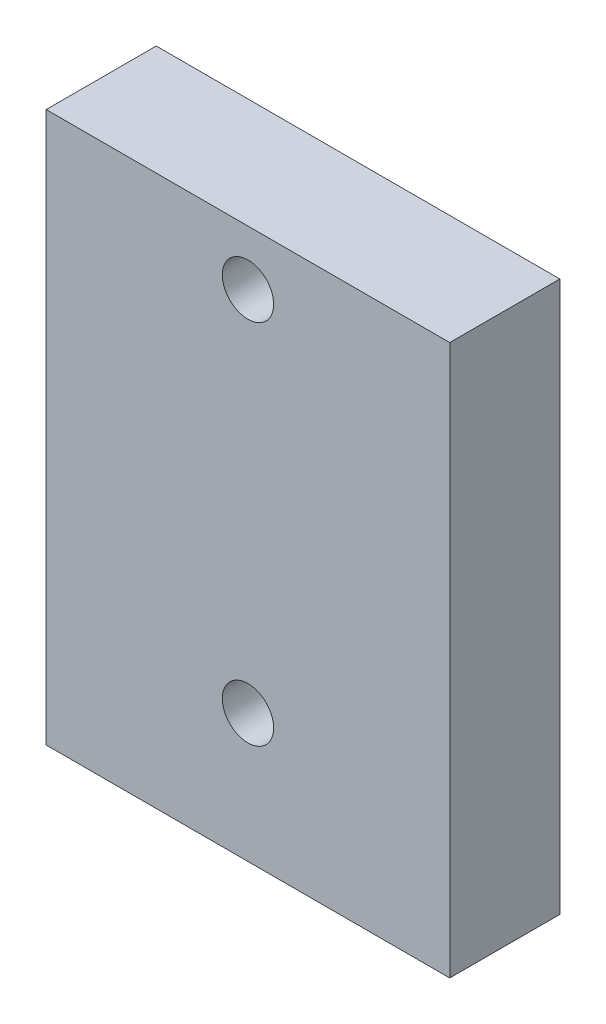
ISO-10303-21;
HEADER;
FILE_DESCRIPTION(('STEP AP214'),'2;1');
FILE_NAME('part.step','',(''),(''),'','','');
FILE_SCHEMA(('AUTOMOTIVE_DESIGN { 1 0 10303 214 1 1 1 1 }'));
ENDSEC;
DATA;
#1=APPLICATION_CONTEXT('core data for automotive mechanical design processes');
#2=APPLICATION_PROTOCOL_DEFINITION('international standard','automotive_design',2000,#1);
#3=PRODUCT_CONTEXT('',#1,'mechanical');
#4=PRODUCT('Part','Part','',(#3));
#5=PRODUCT_RELATED_PRODUCT_CATEGORY('part','',(#4));
#6=PRODUCT_DEFINITION_FORMATION('','',#4);
#7=PRODUCT_DEFINITION_CONTEXT('part definition',#1,'design');
#8=PRODUCT_DEFINITION('design','',#6,#7);
#9=PRODUCT_DEFINITION_SHAPE('','',#8);
#10=(LENGTH_UNIT() NAMED_UNIT(*) SI_UNIT(.MILLI.,.METRE.));
#11=(NAMED_UNIT(*) PLANE_ANGLE_UNIT() SI_UNIT($,.RADIAN.));
#12=(NAMED_UNIT(*) SI_UNIT($,.STERADIAN.) SOLID_ANGLE_UNIT());
#13=UNCERTAINTY_MEASURE_WITH_UNIT(LENGTH_MEASURE(1.E-05),#10,'distance_accuracy_value','');
#14=(GEOMETRIC_REPRESENTATION_CONTEXT(3) GLOBAL_UNCERTAINTY_ASSIGNED_CONTEXT((#13)) GLOBAL_UNIT_ASSIGNED_CONTEXT((#10,
#11,#12)) REPRESENTATION_CONTEXT('',''));
#15=CARTESIAN_POINT('',(0.,0.,0.));
#16=DIRECTION('',(0.,0.,1.));
#17=DIRECTION('',(1.,0.,0.));
#18=AXIS2_PLACEMENT_3D('',#15,#16,#17);
#19=CARTESIAN_POINT('',(0.,0.,6.));
#20=DIRECTION('',(0.,0.,1.));
#21=DIRECTION('',(1.,0.,0.));
#22=AXIS2_PLACEMENT_3D('',#19,#20,#21);
#23=PLANE('',#22);
#24=CARTESIAN_POINT('',(-4.30143276438645,12.3930131004367,6.));
#25=DIRECTION('',(0.,0.,1.));
#26=DIRECTION('',(1.,0.,0.));
#27=AXIS2_PLACEMENT_3D('',#24,#25,#26);
#28=CIRCLE('',#27,1.4);
#29=CARTESIAN_POINT('',(-2.90143276438645,12.3930131004367,6.));
#30=VERTEX_POINT('',#29);
#31=EDGE_CURVE('E102',#30,#30,#28,.T.);
#32=ORIENTED_EDGE('',*,*,#31,.F.);
#33=EDGE_LOOP('',(#32));
#34=FACE_BOUND('',#33,.T.);
#35=DIRECTION('',(0.,-1.,0.));
#36=VECTOR('',#35,1.);
#37=CARTESIAN_POINT('',(-15.3014327643864,15.3930131004367,6.));
#38=LINE('',#37,#36);
#39=CARTESIAN_POINT('',(-15.3014327643864,15.3930131004367,6.));
#40=VERTEX_POINT('',#39);
#41=CARTESIAN_POINT('',(-15.3014327643864,-14.6069868995633,6.));
#42=VERTEX_POINT('',#41);
#43=EDGE_CURVE('E87',#40,#42,#38,.T.);
#44=ORIENTED_EDGE('',*,*,#43,.T.);
#45=DIRECTION('',(1.,0.,0.));
#46=VECTOR('',#45,1.);
#47=CARTESIAN_POINT('',(-15.3014327643864,-14.6069868995633,6.));
#48=LINE('',#47,#46);
#49=CARTESIAN_POINT('',(6.69856723561356,-14.6069868995633,6.));
#50=VERTEX_POINT('',#49);
#51=EDGE_CURVE('E82',#42,#50,#48,.T.);
#52=ORIENTED_EDGE('',*,*,#51,.T.);
#53=DIRECTION('',(0.,1.,0.));
#54=VECTOR('',#53,1.);
#55=CARTESIAN_POINT('',(6.69856723561355,15.3930131004367,6.));
#56=LINE('',#55,#54);
#57=CARTESIAN_POINT('',(6.69856723561355,15.3930131004367,6.));
#58=VERTEX_POINT('',#57);
#59=EDGE_CURVE('E85',#50,#58,#56,.T.);
#60=ORIENTED_EDGE('',*,*,#59,.T.);
#61=DIRECTION('',(-1.,0.,0.));
#62=VECTOR('',#61,1.);
#63=CARTESIAN_POINT('',(-15.3014327643864,15.3930131004367,6.));
#64=LINE('',#63,#62);
#65=EDGE_CURVE('E52',#58,#40,#64,.T.);
#66=ORIENTED_EDGE('',*,*,#65,.T.);
#67=EDGE_LOOP('',(#44,#52,#60,#66));
#68=FACE_BOUND('',#67,.T.);
#69=CARTESIAN_POINT('',(-4.30143276438644,-7.60698689956332,6.));
#70=DIRECTION('',(0.,0.,1.));
#71=DIRECTION('',(1.,0.,0.));
#72=AXIS2_PLACEMENT_3D('',#69,#70,#71);
#73=CIRCLE('',#72,1.4);
#74=CARTESIAN_POINT('',(-2.90143276438644,-7.60698689956332,6.));
#75=VERTEX_POINT('',#74);
#76=EDGE_CURVE('E117',#75,#75,#73,.T.);
#77=ORIENTED_EDGE('',*,*,#76,.F.);
#78=EDGE_LOOP('',(#77));
#79=FACE_BOUND('',#78,.T.);
#80=ADVANCED_FACE('F35',(#34,#68,#79),#23,.T.);
#81=CARTESIAN_POINT('',(0.,0.,0.));
#82=DIRECTION('',(0.,0.,1.));
#83=DIRECTION('',(1.,0.,0.));
#84=AXIS2_PLACEMENT_3D('',#81,#82,#83);
#85=PLANE('',#84);
#86=DIRECTION('',(0.,-1.,0.));
#87=VECTOR('',#86,1.);
#88=CARTESIAN_POINT('',(-15.3014327643864,15.3930131004367,0.));
#89=LINE('',#88,#87);
#90=CARTESIAN_POINT('',(-15.3014327643864,15.3930131004367,0.));
#91=VERTEX_POINT('',#90);
#92=CARTESIAN_POINT('',(-15.3014327643864,-14.6069868995633,0.));
#93=VERTEX_POINT('',#92);
#94=EDGE_CURVE('E99',#91,#93,#89,.T.);
#95=ORIENTED_EDGE('',*,*,#94,.F.);
#96=DIRECTION('',(-1.,0.,0.));
#97=VECTOR('',#96,1.);
#98=CARTESIAN_POINT('',(-15.3014327643864,15.3930131004367,0.));
#99=LINE('',#98,#97);
#100=CARTESIAN_POINT('',(6.69856723561355,15.3930131004367,0.));
#101=VERTEX_POINT('',#100);
#102=EDGE_CURVE('E75',#101,#91,#99,.T.);
#103=ORIENTED_EDGE('',*,*,#102,.F.);
#104=DIRECTION('',(0.,1.,0.));
#105=VECTOR('',#104,1.);
#106=CARTESIAN_POINT('',(6.69856723561355,15.3930131004367,0.));
#107=LINE('',#106,#105);
#108=CARTESIAN_POINT('',(6.69856723561356,-14.6069868995633,0.));
#109=VERTEX_POINT('',#108);
#110=EDGE_CURVE('E69',#109,#101,#107,.T.);
#111=ORIENTED_EDGE('',*,*,#110,.F.);
#112=DIRECTION('',(1.,0.,0.));
#113=VECTOR('',#112,1.);
#114=CARTESIAN_POINT('',(-15.3014327643864,-14.6069868995633,0.));
#115=LINE('',#114,#113);
#116=EDGE_CURVE('E91',#93,#109,#115,.T.);
#117=ORIENTED_EDGE('',*,*,#116,.F.);
#118=EDGE_LOOP('',(#95,#103,#111,#117));
#119=FACE_BOUND('',#118,.T.);
#120=CARTESIAN_POINT('',(-4.30143276438645,12.3930131004367,0.));
#121=DIRECTION('',(0.,0.,1.));
#122=DIRECTION('',(1.,0.,0.));
#123=AXIS2_PLACEMENT_3D('',#120,#121,#122);
#124=CIRCLE('',#123,1.4);
#125=CARTESIAN_POINT('',(-2.90143276438645,12.3930131004367,0.));
#126=VERTEX_POINT('',#125);
#127=EDGE_CURVE('E114',#126,#126,#124,.T.);
#128=ORIENTED_EDGE('',*,*,#127,.T.);
#129=EDGE_LOOP('',(#128));
#130=FACE_BOUND('',#129,.T.);
#131=CARTESIAN_POINT('',(-4.30143276438644,-7.60698689956332,0.));
#132=DIRECTION('',(0.,0.,1.));
#133=DIRECTION('',(1.,0.,0.));
#134=AXIS2_PLACEMENT_3D('',#131,#132,#133);
#135=CIRCLE('',#134,1.4);
#136=CARTESIAN_POINT('',(-2.90143276438644,-7.60698689956332,0.));
#137=VERTEX_POINT('',#136);
#138=EDGE_CURVE('E120',#137,#137,#135,.T.);
#139=ORIENTED_EDGE('',*,*,#138,.T.);
#140=EDGE_LOOP('',(#139));
#141=FACE_BOUND('',#140,.T.);
#142=ADVANCED_FACE('F110',(#119,#130,#141),#85,.F.);
#143=CARTESIAN_POINT('',(-15.3014327643864,15.3930131004367,6.));
#144=DIRECTION('',(1.,0.,0.));
#145=DIRECTION('',(0.,0.,-1.));
#146=AXIS2_PLACEMENT_3D('',#143,#144,#145);
#147=PLANE('',#146);
#148=ORIENTED_EDGE('',*,*,#94,.T.);
#149=DIRECTION('',(0.,0.,-1.));
#150=VECTOR('',#149,1.);
#151=CARTESIAN_POINT('',(-15.3014327643864,-14.6069868995633,6.));
#152=LINE('',#151,#150);
#153=EDGE_CURVE('E11',#42,#93,#152,.T.);
#154=ORIENTED_EDGE('',*,*,#153,.F.);
#155=ORIENTED_EDGE('',*,*,#43,.F.);
#156=DIRECTION('',(0.,0.,-1.));
#157=VECTOR('',#156,1.);
#158=CARTESIAN_POINT('',(-15.3014327643864,15.3930131004367,6.));
#159=LINE('',#158,#157);
#160=EDGE_CURVE('E95',#40,#91,#159,.T.);
#161=ORIENTED_EDGE('',*,*,#160,.T.);
#162=EDGE_LOOP('',(#148,#154,#155,#161));
#163=FACE_BOUND('',#162,.T.);
#164=ADVANCED_FACE('F37',(#163),#147,.F.);
#165=CARTESIAN_POINT('',(-15.3014327643864,-14.6069868995633,6.));
#166=DIRECTION('',(0.,1.,0.));
#167=DIRECTION('',(-1.,0.,0.));
#168=AXIS2_PLACEMENT_3D('',#165,#166,#167);
#169=PLANE('',#168);
#170=ORIENTED_EDGE('',*,*,#116,.T.);
#171=DIRECTION('',(0.,0.,-1.));
#172=VECTOR('',#171,1.);
#173=CARTESIAN_POINT('',(6.69856723561356,-14.6069868995633,6.));
#174=LINE('',#173,#172);
#175=EDGE_CURVE('E44',#50,#109,#174,.T.);
#176=ORIENTED_EDGE('',*,*,#175,.F.);
#177=ORIENTED_EDGE('',*,*,#51,.F.);
#178=ORIENTED_EDGE('',*,*,#153,.T.);
#179=EDGE_LOOP('',(#170,#176,#177,#178));
#180=FACE_BOUND('',#179,.T.);
#181=ADVANCED_FACE('F90',(#180),#169,.F.);
#182=CARTESIAN_POINT('',(6.69856723561355,15.3930131004367,6.));
#183=DIRECTION('',(-1.,0.,0.));
#184=DIRECTION('',(0.,-1.,0.));
#185=AXIS2_PLACEMENT_3D('',#182,#183,#184);
#186=PLANE('',#185);
#187=ORIENTED_EDGE('',*,*,#110,.T.);
#188=DIRECTION('',(0.,0.,-1.));
#189=VECTOR('',#188,1.);
#190=CARTESIAN_POINT('',(6.69856723561355,15.3930131004367,6.));
#191=LINE('',#190,#189);
#192=EDGE_CURVE('E92',#58,#101,#191,.T.);
#193=ORIENTED_EDGE('',*,*,#192,.F.);
#194=ORIENTED_EDGE('',*,*,#59,.F.);
#195=ORIENTED_EDGE('',*,*,#175,.T.);
#196=EDGE_LOOP('',(#187,#193,#194,#195));
#197=FACE_BOUND('',#196,.T.);
#198=ADVANCED_FACE('F93',(#197),#186,.F.);
#199=CARTESIAN_POINT('',(-15.3014327643864,15.3930131004367,6.));
#200=DIRECTION('',(0.,-1.,0.));
#201=DIRECTION('',(0.,0.,-1.));
#202=AXIS2_PLACEMENT_3D('',#199,#200,#201);
#203=PLANE('',#202);
#204=ORIENTED_EDGE('',*,*,#102,.T.);
#205=ORIENTED_EDGE('',*,*,#160,.F.);
#206=ORIENTED_EDGE('',*,*,#65,.F.);
#207=ORIENTED_EDGE('',*,*,#192,.T.);
#208=EDGE_LOOP('',(#204,#205,#206,#207));
#209=FACE_BOUND('',#208,.T.);
#210=ADVANCED_FACE('F107',(#209),#203,.F.);
#211=CARTESIAN_POINT('',(-4.30143276438645,12.3930131004367,6.));
#212=DIRECTION('',(0.,0.,-1.));
#213=DIRECTION('',(-1.,0.,0.));
#214=AXIS2_PLACEMENT_3D('',#211,#212,#213);
#215=CYLINDRICAL_SURFACE('',#214,1.4);
#216=ORIENTED_EDGE('',*,*,#31,.T.);
#217=EDGE_LOOP('',(#216));
#218=FACE_BOUND('',#217,.T.);
#219=ORIENTED_EDGE('',*,*,#127,.F.);
#220=EDGE_LOOP('',(#219));
#221=FACE_BOUND('',#220,.T.);
#222=ADVANCED_FACE('F137',(#218,#221),#215,.F.);
#223=CARTESIAN_POINT('',(-4.30143276438644,-7.60698689956332,6.));
#224=DIRECTION('',(0.,0.,-1.));
#225=DIRECTION('',(-1.,0.,0.));
#226=AXIS2_PLACEMENT_3D('',#223,#224,#225);
#227=CYLINDRICAL_SURFACE('',#226,1.4);
#228=ORIENTED_EDGE('',*,*,#76,.T.);
#229=EDGE_LOOP('',(#228));
#230=FACE_BOUND('',#229,.T.);
#231=ORIENTED_EDGE('',*,*,#138,.F.);
#232=EDGE_LOOP('',(#231));
#233=FACE_BOUND('',#232,.T.);
#234=ADVANCED_FACE('F126',(#230,#233),#227,.F.);
#235=CLOSED_SHELL('',(#80,#142,#164,#181,#198,#210,#222,#234));
#236=MANIFOLD_SOLID_BREP('B2',#235);
#237=ADVANCED_BREP_SHAPE_REPRESENTATION('',(#18,#236),#14);
#238=SHAPE_DEFINITION_REPRESENTATION(#9,#237);
ENDSEC;
END-ISO-10303-21;
